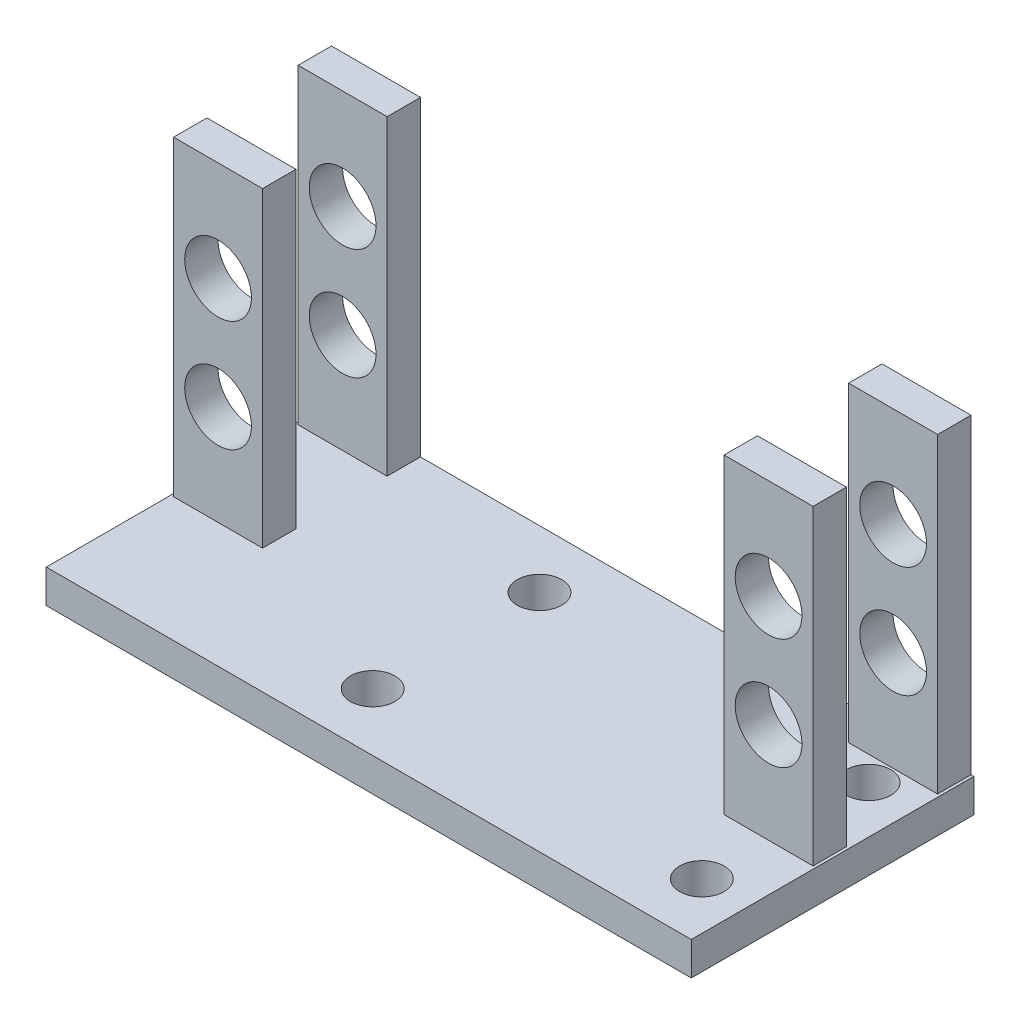
ISO-10303-21;
HEADER;
FILE_DESCRIPTION(('STEP AP214'),'2;1');
FILE_NAME('part.step','',(''),(''),'','','');
FILE_SCHEMA(('AUTOMOTIVE_DESIGN { 1 0 10303 214 1 1 1 1 }'));
ENDSEC;
DATA;
#1=APPLICATION_CONTEXT('core data for automotive mechanical design processes');
#2=APPLICATION_PROTOCOL_DEFINITION('international standard','automotive_design',2000,#1);
#3=PRODUCT_CONTEXT('',#1,'mechanical');
#4=PRODUCT('Part','Part','',(#3));
#5=PRODUCT_RELATED_PRODUCT_CATEGORY('part','',(#4));
#6=PRODUCT_DEFINITION_FORMATION('','',#4);
#7=PRODUCT_DEFINITION_CONTEXT('part definition',#1,'design');
#8=PRODUCT_DEFINITION('design','',#6,#7);
#9=PRODUCT_DEFINITION_SHAPE('','',#8);
#10=(LENGTH_UNIT() NAMED_UNIT(*) SI_UNIT(.MILLI.,.METRE.));
#11=(NAMED_UNIT(*) PLANE_ANGLE_UNIT() SI_UNIT($,.RADIAN.));
#12=(NAMED_UNIT(*) SI_UNIT($,.STERADIAN.) SOLID_ANGLE_UNIT());
#13=UNCERTAINTY_MEASURE_WITH_UNIT(LENGTH_MEASURE(1.E-05),#10,'distance_accuracy_value','');
#14=(GEOMETRIC_REPRESENTATION_CONTEXT(3) GLOBAL_UNCERTAINTY_ASSIGNED_CONTEXT((#13)) GLOBAL_UNIT_ASSIGNED_CONTEXT((#10,
#11,#12)) REPRESENTATION_CONTEXT('',''));
#15=CARTESIAN_POINT('',(0.,0.,0.));
#16=DIRECTION('',(0.,0.,1.));
#17=DIRECTION('',(1.,0.,0.));
#18=AXIS2_PLACEMENT_3D('',#15,#16,#17);
#19=CARTESIAN_POINT('',(0.,3.,0.));
#20=DIRECTION('',(0.,1.,0.));
#21=DIRECTION('',(0.,0.,1.));
#22=AXIS2_PLACEMENT_3D('',#19,#20,#21);
#23=PLANE('',#22);
#24=CARTESIAN_POINT('',(-4.85,3.,7.5));
#25=DIRECTION('',(0.,1.,0.));
#26=DIRECTION('',(0.,0.,-1.));
#27=AXIS2_PLACEMENT_3D('',#24,#25,#26);
#28=CIRCLE('',#27,2.);
#29=CARTESIAN_POINT('',(-4.85,3.,5.5));
#30=VERTEX_POINT('',#29);
#31=EDGE_CURVE('E542',#30,#30,#28,.T.);
#32=ORIENTED_EDGE('',*,*,#31,.F.);
#33=EDGE_LOOP('',(#32));
#34=FACE_BOUND('',#33,.T.);
#35=CARTESIAN_POINT('',(24.75,3.,-7.5));
#36=DIRECTION('',(0.,1.,0.));
#37=DIRECTION('',(0.,0.,-1.));
#38=AXIS2_PLACEMENT_3D('',#35,#36,#37);
#39=CIRCLE('',#38,2.);
#40=CARTESIAN_POINT('',(24.75,3.,-9.5));
#41=VERTEX_POINT('',#40);
#42=EDGE_CURVE('E538',#41,#41,#39,.T.);
#43=ORIENTED_EDGE('',*,*,#42,.F.);
#44=EDGE_LOOP('',(#43));
#45=FACE_BOUND('',#44,.T.);
#46=CARTESIAN_POINT('',(24.75,3.,7.5));
#47=DIRECTION('',(0.,1.,0.));
#48=DIRECTION('',(0.,0.,1.));
#49=AXIS2_PLACEMENT_3D('',#46,#47,#48);
#50=CIRCLE('',#49,2.);
#51=CARTESIAN_POINT('',(24.75,3.,9.5));
#52=VERTEX_POINT('',#51);
#53=EDGE_CURVE('E535',#52,#52,#50,.T.);
#54=ORIENTED_EDGE('',*,*,#53,.F.);
#55=EDGE_LOOP('',(#54));
#56=FACE_BOUND('',#55,.T.);
#57=CARTESIAN_POINT('',(-4.85,3.,-7.5));
#58=DIRECTION('',(0.,1.,0.));
#59=DIRECTION('',(0.,0.,1.));
#60=AXIS2_PLACEMENT_3D('',#57,#58,#59);
#61=CIRCLE('',#60,2.);
#62=CARTESIAN_POINT('',(-4.85,3.,-5.5));
#63=VERTEX_POINT('',#62);
#64=EDGE_CURVE('E341',#63,#63,#61,.T.);
#65=ORIENTED_EDGE('',*,*,#64,.F.);
#66=EDGE_LOOP('',(#65));
#67=FACE_BOUND('',#66,.T.);
#68=DIRECTION('',(-1.,0.,0.));
#69=VECTOR('',#68,1.);
#70=CARTESIAN_POINT('',(-29.,3.,-12.7));
#71=LINE('',#70,#69);
#72=CARTESIAN_POINT('',(29.,3.,-12.7));
#73=VERTEX_POINT('',#72);
#74=CARTESIAN_POINT('',(28.75,3.,-12.7));
#75=VERTEX_POINT('',#74);
#76=EDGE_CURVE('E295',#73,#75,#71,.T.);
#77=ORIENTED_EDGE('',*,*,#76,.T.);
#78=DIRECTION('',(0.,0.,-1.));
#79=VECTOR('',#78,1.);
#80=CARTESIAN_POINT('',(28.75,3.,-9.7));
#81=LINE('',#80,#79);
#82=CARTESIAN_POINT('',(28.75,3.,-9.7));
#83=VERTEX_POINT('',#82);
#84=EDGE_CURVE('E233',#83,#75,#81,.T.);
#85=ORIENTED_EDGE('',*,*,#84,.F.);
#86=DIRECTION('',(1.,0.,0.));
#87=VECTOR('',#86,1.);
#88=CARTESIAN_POINT('',(20.75,3.,-9.7));
#89=LINE('',#88,#87);
#90=CARTESIAN_POINT('',(20.75,3.,-9.7));
#91=VERTEX_POINT('',#90);
#92=EDGE_CURVE('E238',#91,#83,#89,.T.);
#93=ORIENTED_EDGE('',*,*,#92,.F.);
#94=DIRECTION('',(0.,0.,1.));
#95=VECTOR('',#94,1.);
#96=CARTESIAN_POINT('',(20.75,3.,-12.7));
#97=LINE('',#96,#95);
#98=CARTESIAN_POINT('',(20.75,3.,-12.7));
#99=VERTEX_POINT('',#98);
#100=EDGE_CURVE('E247',#99,#91,#97,.T.);
#101=ORIENTED_EDGE('',*,*,#100,.F.);
#102=CARTESIAN_POINT('',(-20.75,3.,-12.7));
#103=VERTEX_POINT('',#102);
#104=EDGE_CURVE('E299',#99,#103,#71,.T.);
#105=ORIENTED_EDGE('',*,*,#104,.T.);
#106=DIRECTION('',(0.,0.,-1.));
#107=VECTOR('',#106,1.);
#108=CARTESIAN_POINT('',(-20.75,3.,-12.7));
#109=LINE('',#108,#107);
#110=CARTESIAN_POINT('',(-20.75,3.,-9.7));
#111=VERTEX_POINT('',#110);
#112=EDGE_CURVE('E264',#111,#103,#109,.T.);
#113=ORIENTED_EDGE('',*,*,#112,.F.);
#114=DIRECTION('',(1.,0.,0.));
#115=VECTOR('',#114,1.);
#116=CARTESIAN_POINT('',(-20.75,3.,-9.7));
#117=LINE('',#116,#115);
#118=CARTESIAN_POINT('',(-28.75,3.,-9.7));
#119=VERTEX_POINT('',#118);
#120=EDGE_CURVE('E273',#119,#111,#117,.T.);
#121=ORIENTED_EDGE('',*,*,#120,.F.);
#122=DIRECTION('',(0.,0.,1.));
#123=VECTOR('',#122,1.);
#124=CARTESIAN_POINT('',(-28.75,3.,-9.7));
#125=LINE('',#124,#123);
#126=CARTESIAN_POINT('',(-28.75,3.,-12.7));
#127=VERTEX_POINT('',#126);
#128=EDGE_CURVE('E259',#127,#119,#125,.T.);
#129=ORIENTED_EDGE('',*,*,#128,.F.);
#130=CARTESIAN_POINT('',(-29.,3.,-12.7));
#131=VERTEX_POINT('',#130);
#132=EDGE_CURVE('E293',#127,#131,#71,.T.);
#133=ORIENTED_EDGE('',*,*,#132,.T.);
#134=DIRECTION('',(0.,0.,1.));
#135=VECTOR('',#134,1.);
#136=CARTESIAN_POINT('',(-29.,3.,-12.7));
#137=LINE('',#136,#135);
#138=CARTESIAN_POINT('',(-29.,3.,12.7));
#139=VERTEX_POINT('',#138);
#140=EDGE_CURVE('E298',#131,#139,#137,.T.);
#141=ORIENTED_EDGE('',*,*,#140,.T.);
#142=DIRECTION('',(1.,0.,0.));
#143=VECTOR('',#142,1.);
#144=CARTESIAN_POINT('',(-29.,3.,12.7));
#145=LINE('',#144,#143);
#146=CARTESIAN_POINT('',(29.,3.,12.7));
#147=VERTEX_POINT('',#146);
#148=EDGE_CURVE('E301',#139,#147,#145,.T.);
#149=ORIENTED_EDGE('',*,*,#148,.T.);
#150=DIRECTION('',(0.,0.,-1.));
#151=VECTOR('',#150,1.);
#152=CARTESIAN_POINT('',(29.,3.,-12.7));
#153=LINE('',#152,#151);
#154=EDGE_CURVE('E290',#147,#73,#153,.T.);
#155=ORIENTED_EDGE('',*,*,#154,.T.);
#156=EDGE_LOOP('',(#77,#85,#93,#101,#105,#113,#121,#129,#133,#141,#149,#155));
#157=FACE_BOUND('',#156,.T.);
#158=DIRECTION('',(-1.,0.,0.));
#159=VECTOR('',#158,1.);
#160=CARTESIAN_POINT('',(-28.75,3.,-1.5));
#161=LINE('',#160,#159);
#162=CARTESIAN_POINT('',(-20.75,3.,-1.5));
#163=VERTEX_POINT('',#162);
#164=CARTESIAN_POINT('',(-28.75,3.,-1.5));
#165=VERTEX_POINT('',#164);
#166=EDGE_CURVE('E205',#163,#165,#161,.T.);
#167=ORIENTED_EDGE('',*,*,#166,.F.);
#168=DIRECTION('',(0.,0.,-1.));
#169=VECTOR('',#168,1.);
#170=CARTESIAN_POINT('',(-20.75,3.,-1.5));
#171=LINE('',#170,#169);
#172=CARTESIAN_POINT('',(-20.75,3.,1.5));
#173=VERTEX_POINT('',#172);
#174=EDGE_CURVE('E202',#173,#163,#171,.T.);
#175=ORIENTED_EDGE('',*,*,#174,.F.);
#176=DIRECTION('',(1.,0.,0.));
#177=VECTOR('',#176,1.);
#178=CARTESIAN_POINT('',(-20.75,3.,1.5));
#179=LINE('',#178,#177);
#180=CARTESIAN_POINT('',(-28.75,3.,1.5));
#181=VERTEX_POINT('',#180);
#182=EDGE_CURVE('E214',#181,#173,#179,.T.);
#183=ORIENTED_EDGE('',*,*,#182,.F.);
#184=DIRECTION('',(0.,0.,1.));
#185=VECTOR('',#184,1.);
#186=CARTESIAN_POINT('',(-28.75,3.,1.5));
#187=LINE('',#186,#185);
#188=EDGE_CURVE('E222',#165,#181,#187,.T.);
#189=ORIENTED_EDGE('',*,*,#188,.F.);
#190=EDGE_LOOP('',(#167,#175,#183,#189));
#191=FACE_BOUND('',#190,.T.);
#192=DIRECTION('',(0.,0.,-1.));
#193=VECTOR('',#192,1.);
#194=CARTESIAN_POINT('',(28.75,3.,1.5));
#195=LINE('',#194,#193);
#196=CARTESIAN_POINT('',(28.75,3.,1.5));
#197=VERTEX_POINT('',#196);
#198=CARTESIAN_POINT('',(28.75,3.,-1.5));
#199=VERTEX_POINT('',#198);
#200=EDGE_CURVE('E571',#197,#199,#195,.T.);
#201=ORIENTED_EDGE('',*,*,#200,.F.);
#202=DIRECTION('',(1.,0.,0.));
#203=VECTOR('',#202,1.);
#204=CARTESIAN_POINT('',(20.75,3.,1.5));
#205=LINE('',#204,#203);
#206=CARTESIAN_POINT('',(20.75,3.,1.5));
#207=VERTEX_POINT('',#206);
#208=EDGE_CURVE('E200',#207,#197,#205,.T.);
#209=ORIENTED_EDGE('',*,*,#208,.F.);
#210=DIRECTION('',(0.,0.,1.));
#211=VECTOR('',#210,1.);
#212=CARTESIAN_POINT('',(20.75,3.,-1.5));
#213=LINE('',#212,#211);
#214=CARTESIAN_POINT('',(20.75,3.,-1.5));
#215=VERTEX_POINT('',#214);
#216=EDGE_CURVE('E196',#215,#207,#213,.T.);
#217=ORIENTED_EDGE('',*,*,#216,.F.);
#218=DIRECTION('',(-1.,0.,0.));
#219=VECTOR('',#218,1.);
#220=CARTESIAN_POINT('',(28.75,3.,-1.5));
#221=LINE('',#220,#219);
#222=EDGE_CURVE('E573',#199,#215,#221,.T.);
#223=ORIENTED_EDGE('',*,*,#222,.F.);
#224=EDGE_LOOP('',(#201,#209,#217,#223));
#225=FACE_BOUND('',#224,.T.);
#226=ADVANCED_FACE('F37',(#34,#45,#56,#67,#157,#191,#225),#23,.T.);
#227=CARTESIAN_POINT('',(29.,3.,-12.7));
#228=DIRECTION('',(-1.,0.,0.));
#229=DIRECTION('',(0.,0.,1.));
#230=AXIS2_PLACEMENT_3D('',#227,#228,#229);
#231=PLANE('',#230);
#232=DIRECTION('',(0.,0.,-1.));
#233=VECTOR('',#232,1.);
#234=CARTESIAN_POINT('',(29.,0.,-12.7));
#235=LINE('',#234,#233);
#236=CARTESIAN_POINT('',(29.,0.,12.7));
#237=VERTEX_POINT('',#236);
#238=CARTESIAN_POINT('',(29.,0.,-12.7));
#239=VERTEX_POINT('',#238);
#240=EDGE_CURVE('E289',#237,#239,#235,.T.);
#241=ORIENTED_EDGE('',*,*,#240,.T.);
#242=DIRECTION('',(0.,-1.,0.));
#243=VECTOR('',#242,1.);
#244=CARTESIAN_POINT('',(29.,3.,-12.7));
#245=LINE('',#244,#243);
#246=EDGE_CURVE('E11',#73,#239,#245,.T.);
#247=ORIENTED_EDGE('',*,*,#246,.F.);
#248=ORIENTED_EDGE('',*,*,#154,.F.);
#249=DIRECTION('',(0.,-1.,0.));
#250=VECTOR('',#249,1.);
#251=CARTESIAN_POINT('',(29.,3.,12.7));
#252=LINE('',#251,#250);
#253=EDGE_CURVE('E303',#147,#237,#252,.T.);
#254=ORIENTED_EDGE('',*,*,#253,.T.);
#255=EDGE_LOOP('',(#241,#247,#248,#254));
#256=FACE_BOUND('',#255,.T.);
#257=ADVANCED_FACE('F39',(#256),#231,.F.);
#258=CARTESIAN_POINT('',(-29.,3.,-12.7));
#259=DIRECTION('',(0.,0.,1.));
#260=DIRECTION('',(1.,0.,0.));
#261=AXIS2_PLACEMENT_3D('',#258,#259,#260);
#262=PLANE('',#261);
#263=CARTESIAN_POINT('',(-24.75,22.,-12.7));
#264=DIRECTION('',(0.,0.,1.));
#265=DIRECTION('',(1.,0.,0.));
#266=AXIS2_PLACEMENT_3D('',#263,#264,#265);
#267=CIRCLE('',#266,3.);
#268=CARTESIAN_POINT('',(-21.75,22.,-12.7));
#269=VERTEX_POINT('',#268);
#270=EDGE_CURVE('E395',#269,#269,#267,.T.);
#271=ORIENTED_EDGE('',*,*,#270,.T.);
#272=EDGE_LOOP('',(#271));
#273=FACE_BOUND('',#272,.T.);
#274=CARTESIAN_POINT('',(24.75,12.,-12.7));
#275=DIRECTION('',(0.,0.,1.));
#276=DIRECTION('',(1.,0.,0.));
#277=AXIS2_PLACEMENT_3D('',#274,#275,#276);
#278=CIRCLE('',#277,3.);
#279=CARTESIAN_POINT('',(27.75,12.,-12.7));
#280=VERTEX_POINT('',#279);
#281=EDGE_CURVE('E331',#280,#280,#278,.T.);
#282=ORIENTED_EDGE('',*,*,#281,.T.);
#283=EDGE_LOOP('',(#282));
#284=FACE_BOUND('',#283,.T.);
#285=CARTESIAN_POINT('',(24.75,22.,-12.7));
#286=DIRECTION('',(0.,0.,1.));
#287=DIRECTION('',(1.,0.,0.));
#288=AXIS2_PLACEMENT_3D('',#285,#286,#287);
#289=CIRCLE('',#288,3.);
#290=CARTESIAN_POINT('',(27.75,22.,-12.7));
#291=VERTEX_POINT('',#290);
#292=EDGE_CURVE('E326',#291,#291,#289,.T.);
#293=ORIENTED_EDGE('',*,*,#292,.T.);
#294=EDGE_LOOP('',(#293));
#295=FACE_BOUND('',#294,.T.);
#296=CARTESIAN_POINT('',(-24.75,12.,-12.7));
#297=DIRECTION('',(0.,0.,1.));
#298=DIRECTION('',(1.,0.,0.));
#299=AXIS2_PLACEMENT_3D('',#296,#297,#298);
#300=CIRCLE('',#299,3.);
#301=CARTESIAN_POINT('',(-21.75,12.,-12.7));
#302=VERTEX_POINT('',#301);
#303=EDGE_CURVE('E336',#302,#302,#300,.T.);
#304=ORIENTED_EDGE('',*,*,#303,.T.);
#305=EDGE_LOOP('',(#304));
#306=FACE_BOUND('',#305,.T.);
#307=DIRECTION('',(-1.,0.,0.));
#308=VECTOR('',#307,1.);
#309=CARTESIAN_POINT('',(-29.,0.,-12.7));
#310=LINE('',#309,#308);
#311=CARTESIAN_POINT('',(-29.,0.,-12.7));
#312=VERTEX_POINT('',#311);
#313=EDGE_CURVE('E306',#239,#312,#310,.T.);
#314=ORIENTED_EDGE('',*,*,#313,.T.);
#315=DIRECTION('',(0.,-1.,0.));
#316=VECTOR('',#315,1.);
#317=CARTESIAN_POINT('',(-29.,3.,-12.7));
#318=LINE('',#317,#316);
#319=EDGE_CURVE('E46',#131,#312,#318,.T.);
#320=ORIENTED_EDGE('',*,*,#319,.F.);
#321=ORIENTED_EDGE('',*,*,#132,.F.);
#322=DIRECTION('',(0.,-1.,0.));
#323=VECTOR('',#322,1.);
#324=CARTESIAN_POINT('',(-28.75,31.,-12.7));
#325=LINE('',#324,#323);
#326=CARTESIAN_POINT('',(-28.75,31.,-12.7));
#327=VERTEX_POINT('',#326);
#328=EDGE_CURVE('E270',#327,#127,#325,.T.);
#329=ORIENTED_EDGE('',*,*,#328,.F.);
#330=DIRECTION('',(-1.,0.,0.));
#331=VECTOR('',#330,1.);
#332=CARTESIAN_POINT('',(-28.75,31.,-12.7));
#333=LINE('',#332,#331);
#334=CARTESIAN_POINT('',(-20.75,31.,-12.7));
#335=VERTEX_POINT('',#334);
#336=EDGE_CURVE('E268',#335,#327,#333,.T.);
#337=ORIENTED_EDGE('',*,*,#336,.F.);
#338=DIRECTION('',(0.,-1.,0.));
#339=VECTOR('',#338,1.);
#340=CARTESIAN_POINT('',(-20.75,31.,-12.7));
#341=LINE('',#340,#339);
#342=EDGE_CURVE('E280',#335,#103,#341,.T.);
#343=ORIENTED_EDGE('',*,*,#342,.T.);
#344=ORIENTED_EDGE('',*,*,#104,.F.);
#345=DIRECTION('',(0.,-1.,0.));
#346=VECTOR('',#345,1.);
#347=CARTESIAN_POINT('',(20.75,31.,-12.7));
#348=LINE('',#347,#346);
#349=CARTESIAN_POINT('',(20.75,31.,-12.7));
#350=VERTEX_POINT('',#349);
#351=EDGE_CURVE('E255',#350,#99,#348,.T.);
#352=ORIENTED_EDGE('',*,*,#351,.F.);
#353=DIRECTION('',(-1.,0.,0.));
#354=VECTOR('',#353,1.);
#355=CARTESIAN_POINT('',(28.75,31.,-12.7));
#356=LINE('',#355,#354);
#357=CARTESIAN_POINT('',(28.75,31.,-12.7));
#358=VERTEX_POINT('',#357);
#359=EDGE_CURVE('E237',#358,#350,#356,.T.);
#360=ORIENTED_EDGE('',*,*,#359,.F.);
#361=DIRECTION('',(0.,-1.,0.));
#362=VECTOR('',#361,1.);
#363=CARTESIAN_POINT('',(28.75,31.,-12.7));
#364=LINE('',#363,#362);
#365=EDGE_CURVE('E257',#358,#75,#364,.T.);
#366=ORIENTED_EDGE('',*,*,#365,.T.);
#367=ORIENTED_EDGE('',*,*,#76,.F.);
#368=ORIENTED_EDGE('',*,*,#246,.T.);
#369=EDGE_LOOP('',(#314,#320,#321,#329,#337,#343,#344,#352,#360,#366,#367,#368));
#370=FACE_BOUND('',#369,.T.);
#371=ADVANCED_FACE('F371',(#273,#284,#295,#306,#370),#262,.F.);
#372=CARTESIAN_POINT('',(-29.,3.,-12.7));
#373=DIRECTION('',(1.,0.,0.));
#374=DIRECTION('',(0.,0.,-1.));
#375=AXIS2_PLACEMENT_3D('',#372,#373,#374);
#376=PLANE('',#375);
#377=DIRECTION('',(0.,0.,1.));
#378=VECTOR('',#377,1.);
#379=CARTESIAN_POINT('',(-29.,0.,-12.7));
#380=LINE('',#379,#378);
#381=CARTESIAN_POINT('',(-29.,0.,12.7));
#382=VERTEX_POINT('',#381);
#383=EDGE_CURVE('E308',#312,#382,#380,.T.);
#384=ORIENTED_EDGE('',*,*,#383,.T.);
#385=DIRECTION('',(0.,-1.,0.));
#386=VECTOR('',#385,1.);
#387=CARTESIAN_POINT('',(-29.,3.,12.7));
#388=LINE('',#387,#386);
#389=EDGE_CURVE('E313',#139,#382,#388,.T.);
#390=ORIENTED_EDGE('',*,*,#389,.F.);
#391=ORIENTED_EDGE('',*,*,#140,.F.);
#392=ORIENTED_EDGE('',*,*,#319,.T.);
#393=EDGE_LOOP('',(#384,#390,#391,#392));
#394=FACE_BOUND('',#393,.T.);
#395=ADVANCED_FACE('F384',(#394),#376,.F.);
#396=CARTESIAN_POINT('',(-29.,3.,12.7));
#397=DIRECTION('',(0.,0.,-1.));
#398=DIRECTION('',(-1.,0.,0.));
#399=AXIS2_PLACEMENT_3D('',#396,#397,#398);
#400=PLANE('',#399);
#401=DIRECTION('',(1.,0.,0.));
#402=VECTOR('',#401,1.);
#403=CARTESIAN_POINT('',(-29.,0.,12.7));
#404=LINE('',#403,#402);
#405=EDGE_CURVE('E294',#382,#237,#404,.T.);
#406=ORIENTED_EDGE('',*,*,#405,.T.);
#407=ORIENTED_EDGE('',*,*,#253,.F.);
#408=ORIENTED_EDGE('',*,*,#148,.F.);
#409=ORIENTED_EDGE('',*,*,#389,.T.);
#410=EDGE_LOOP('',(#406,#407,#408,#409));
#411=FACE_BOUND('',#410,.T.);
#412=ADVANCED_FACE('F381',(#411),#400,.F.);
#413=CARTESIAN_POINT('',(0.,0.,0.));
#414=DIRECTION('',(0.,1.,0.));
#415=DIRECTION('',(0.,0.,1.));
#416=AXIS2_PLACEMENT_3D('',#413,#414,#415);
#417=PLANE('',#416);
#418=CARTESIAN_POINT('',(-4.85,0.,7.5));
#419=DIRECTION('',(0.,1.,0.));
#420=DIRECTION('',(0.,0.,1.));
#421=AXIS2_PLACEMENT_3D('',#418,#419,#420);
#422=CIRCLE('',#421,2.);
#423=CARTESIAN_POINT('',(-4.85,0.,9.5));
#424=VERTEX_POINT('',#423);
#425=EDGE_CURVE('E41',#424,#424,#422,.T.);
#426=ORIENTED_EDGE('',*,*,#425,.T.);
#427=EDGE_LOOP('',(#426));
#428=FACE_BOUND('',#427,.T.);
#429=CARTESIAN_POINT('',(24.75,0.,-7.5));
#430=DIRECTION('',(0.,1.,0.));
#431=DIRECTION('',(0.,0.,1.));
#432=AXIS2_PLACEMENT_3D('',#429,#430,#431);
#433=CIRCLE('',#432,2.);
#434=CARTESIAN_POINT('',(24.75,0.,-5.5));
#435=VERTEX_POINT('',#434);
#436=EDGE_CURVE('E343',#435,#435,#433,.T.);
#437=ORIENTED_EDGE('',*,*,#436,.T.);
#438=EDGE_LOOP('',(#437));
#439=FACE_BOUND('',#438,.T.);
#440=CARTESIAN_POINT('',(24.75,0.,7.5));
#441=DIRECTION('',(0.,1.,0.));
#442=DIRECTION('',(0.,0.,1.));
#443=AXIS2_PLACEMENT_3D('',#440,#441,#442);
#444=CIRCLE('',#443,2.);
#445=CARTESIAN_POINT('',(24.75,0.,9.5));
#446=VERTEX_POINT('',#445);
#447=EDGE_CURVE('E340',#446,#446,#444,.T.);
#448=ORIENTED_EDGE('',*,*,#447,.T.);
#449=EDGE_LOOP('',(#448));
#450=FACE_BOUND('',#449,.T.);
#451=CARTESIAN_POINT('',(-4.85,0.,-7.5));
#452=DIRECTION('',(0.,1.,0.));
#453=DIRECTION('',(0.,0.,1.));
#454=AXIS2_PLACEMENT_3D('',#451,#452,#453);
#455=CIRCLE('',#454,2.);
#456=CARTESIAN_POINT('',(-4.85,0.,-5.5));
#457=VERTEX_POINT('',#456);
#458=EDGE_CURVE('E337',#457,#457,#455,.T.);
#459=ORIENTED_EDGE('',*,*,#458,.T.);
#460=EDGE_LOOP('',(#459));
#461=FACE_BOUND('',#460,.T.);
#462=ORIENTED_EDGE('',*,*,#240,.F.);
#463=ORIENTED_EDGE('',*,*,#405,.F.);
#464=ORIENTED_EDGE('',*,*,#383,.F.);
#465=ORIENTED_EDGE('',*,*,#313,.F.);
#466=EDGE_LOOP('',(#462,#463,#464,#465));
#467=FACE_BOUND('',#466,.T.);
#468=ADVANCED_FACE('F350',(#428,#439,#450,#461,#467),#417,.F.);
#469=CARTESIAN_POINT('',(-28.75,31.,-9.7));
#470=DIRECTION('',(1.,0.,0.));
#471=DIRECTION('',(0.,0.,-1.));
#472=AXIS2_PLACEMENT_3D('',#469,#470,#471);
#473=PLANE('',#472);
#474=ORIENTED_EDGE('',*,*,#128,.T.);
#475=DIRECTION('',(0.,-1.,0.));
#476=VECTOR('',#475,1.);
#477=CARTESIAN_POINT('',(-28.75,31.,-9.7));
#478=LINE('',#477,#476);
#479=CARTESIAN_POINT('',(-28.75,31.,-9.7));
#480=VERTEX_POINT('',#479);
#481=EDGE_CURVE('E286',#480,#119,#478,.T.);
#482=ORIENTED_EDGE('',*,*,#481,.F.);
#483=DIRECTION('',(0.,0.,1.));
#484=VECTOR('',#483,1.);
#485=CARTESIAN_POINT('',(-28.75,31.,-9.7));
#486=LINE('',#485,#484);
#487=EDGE_CURVE('E260',#327,#480,#486,.T.);
#488=ORIENTED_EDGE('',*,*,#487,.F.);
#489=ORIENTED_EDGE('',*,*,#328,.T.);
#490=EDGE_LOOP('',(#474,#482,#488,#489));
#491=FACE_BOUND('',#490,.T.);
#492=ADVANCED_FACE('F377',(#491),#473,.F.);
#493=CARTESIAN_POINT('',(-20.75,31.,-9.7));
#494=DIRECTION('',(0.,0.,-1.));
#495=DIRECTION('',(-1.,0.,0.));
#496=AXIS2_PLACEMENT_3D('',#493,#494,#495);
#497=PLANE('',#496);
#498=CARTESIAN_POINT('',(-24.75,22.,-9.7));
#499=DIRECTION('',(0.,0.,-1.));
#500=DIRECTION('',(-1.,0.,0.));
#501=AXIS2_PLACEMENT_3D('',#498,#499,#500);
#502=CIRCLE('',#501,3.);
#503=CARTESIAN_POINT('',(-27.75,22.,-9.7));
#504=VERTEX_POINT('',#503);
#505=EDGE_CURVE('E564',#504,#504,#502,.T.);
#506=ORIENTED_EDGE('',*,*,#505,.T.);
#507=EDGE_LOOP('',(#506));
#508=FACE_BOUND('',#507,.T.);
#509=CARTESIAN_POINT('',(-24.75,12.,-9.7));
#510=DIRECTION('',(0.,0.,-1.));
#511=DIRECTION('',(-1.,0.,0.));
#512=AXIS2_PLACEMENT_3D('',#509,#510,#511);
#513=CIRCLE('',#512,3.);
#514=CARTESIAN_POINT('',(-27.75,12.,-9.7));
#515=VERTEX_POINT('',#514);
#516=EDGE_CURVE('E558',#515,#515,#513,.T.);
#517=ORIENTED_EDGE('',*,*,#516,.T.);
#518=EDGE_LOOP('',(#517));
#519=FACE_BOUND('',#518,.T.);
#520=ORIENTED_EDGE('',*,*,#120,.T.);
#521=DIRECTION('',(0.,-1.,0.));
#522=VECTOR('',#521,1.);
#523=CARTESIAN_POINT('',(-20.75,31.,-9.7));
#524=LINE('',#523,#522);
#525=CARTESIAN_POINT('',(-20.75,31.,-9.7));
#526=VERTEX_POINT('',#525);
#527=EDGE_CURVE('E283',#526,#111,#524,.T.);
#528=ORIENTED_EDGE('',*,*,#527,.F.);
#529=DIRECTION('',(1.,0.,0.));
#530=VECTOR('',#529,1.);
#531=CARTESIAN_POINT('',(-20.75,31.,-9.7));
#532=LINE('',#531,#530);
#533=EDGE_CURVE('E263',#480,#526,#532,.T.);
#534=ORIENTED_EDGE('',*,*,#533,.F.);
#535=ORIENTED_EDGE('',*,*,#481,.T.);
#536=EDGE_LOOP('',(#520,#528,#534,#535));
#537=FACE_BOUND('',#536,.T.);
#538=ADVANCED_FACE('F436',(#508,#519,#537),#497,.F.);
#539=CARTESIAN_POINT('',(-20.75,31.,-12.7));
#540=DIRECTION('',(-1.,0.,0.));
#541=DIRECTION('',(0.,0.,1.));
#542=AXIS2_PLACEMENT_3D('',#539,#540,#541);
#543=PLANE('',#542);
#544=ORIENTED_EDGE('',*,*,#112,.T.);
#545=ORIENTED_EDGE('',*,*,#342,.F.);
#546=DIRECTION('',(0.,0.,-1.));
#547=VECTOR('',#546,1.);
#548=CARTESIAN_POINT('',(-20.75,31.,-12.7));
#549=LINE('',#548,#547);
#550=EDGE_CURVE('E266',#526,#335,#549,.T.);
#551=ORIENTED_EDGE('',*,*,#550,.F.);
#552=ORIENTED_EDGE('',*,*,#527,.T.);
#553=EDGE_LOOP('',(#544,#545,#551,#552));
#554=FACE_BOUND('',#553,.T.);
#555=ADVANCED_FACE('F427',(#554),#543,.F.);
#556=CARTESIAN_POINT('',(0.,31.,0.));
#557=DIRECTION('',(0.,-1.,0.));
#558=DIRECTION('',(0.,0.,-1.));
#559=AXIS2_PLACEMENT_3D('',#556,#557,#558);
#560=PLANE('',#559);
#561=ORIENTED_EDGE('',*,*,#487,.T.);
#562=ORIENTED_EDGE('',*,*,#533,.T.);
#563=ORIENTED_EDGE('',*,*,#550,.T.);
#564=ORIENTED_EDGE('',*,*,#336,.T.);
#565=EDGE_LOOP('',(#561,#562,#563,#564));
#566=FACE_BOUND('',#565,.T.);
#567=ADVANCED_FACE('F433',(#566),#560,.F.);
#568=CARTESIAN_POINT('',(28.75,31.,-9.7));
#569=DIRECTION('',(-1.,0.,0.));
#570=DIRECTION('',(0.,0.,1.));
#571=AXIS2_PLACEMENT_3D('',#568,#569,#570);
#572=PLANE('',#571);
#573=ORIENTED_EDGE('',*,*,#84,.T.);
#574=ORIENTED_EDGE('',*,*,#365,.F.);
#575=DIRECTION('',(0.,0.,-1.));
#576=VECTOR('',#575,1.);
#577=CARTESIAN_POINT('',(28.75,31.,-9.7));
#578=LINE('',#577,#576);
#579=CARTESIAN_POINT('',(28.75,31.,-9.7));
#580=VERTEX_POINT('',#579);
#581=EDGE_CURVE('E234',#580,#358,#578,.T.);
#582=ORIENTED_EDGE('',*,*,#581,.F.);
#583=DIRECTION('',(0.,-1.,0.));
#584=VECTOR('',#583,1.);
#585=CARTESIAN_POINT('',(28.75,31.,-9.7));
#586=LINE('',#585,#584);
#587=EDGE_CURVE('E244',#580,#83,#586,.T.);
#588=ORIENTED_EDGE('',*,*,#587,.T.);
#589=EDGE_LOOP('',(#573,#574,#582,#588));
#590=FACE_BOUND('',#589,.T.);
#591=ADVANCED_FACE('F452',(#590),#572,.F.);
#592=CARTESIAN_POINT('',(20.75,31.,-12.7));
#593=DIRECTION('',(1.,0.,0.));
#594=DIRECTION('',(0.,0.,-1.));
#595=AXIS2_PLACEMENT_3D('',#592,#593,#594);
#596=PLANE('',#595);
#597=ORIENTED_EDGE('',*,*,#100,.T.);
#598=DIRECTION('',(0.,-1.,0.));
#599=VECTOR('',#598,1.);
#600=CARTESIAN_POINT('',(20.75,31.,-9.7));
#601=LINE('',#600,#599);
#602=CARTESIAN_POINT('',(20.75,31.,-9.7));
#603=VERTEX_POINT('',#602);
#604=EDGE_CURVE('E253',#603,#91,#601,.T.);
#605=ORIENTED_EDGE('',*,*,#604,.F.);
#606=DIRECTION('',(0.,0.,1.));
#607=VECTOR('',#606,1.);
#608=CARTESIAN_POINT('',(20.75,31.,-12.7));
#609=LINE('',#608,#607);
#610=EDGE_CURVE('E240',#350,#603,#609,.T.);
#611=ORIENTED_EDGE('',*,*,#610,.F.);
#612=ORIENTED_EDGE('',*,*,#351,.T.);
#613=EDGE_LOOP('',(#597,#605,#611,#612));
#614=FACE_BOUND('',#613,.T.);
#615=ADVANCED_FACE('F455',(#614),#596,.F.);
#616=CARTESIAN_POINT('',(20.75,31.,-9.7));
#617=DIRECTION('',(0.,0.,-1.));
#618=DIRECTION('',(-1.,0.,0.));
#619=AXIS2_PLACEMENT_3D('',#616,#617,#618);
#620=PLANE('',#619);
#621=CARTESIAN_POINT('',(24.75,12.,-9.7));
#622=DIRECTION('',(0.,0.,-1.));
#623=DIRECTION('',(-1.,0.,0.));
#624=AXIS2_PLACEMENT_3D('',#621,#622,#623);
#625=CIRCLE('',#624,3.);
#626=CARTESIAN_POINT('',(21.75,12.,-9.7));
#627=VERTEX_POINT('',#626);
#628=EDGE_CURVE('E552',#627,#627,#625,.T.);
#629=ORIENTED_EDGE('',*,*,#628,.T.);
#630=EDGE_LOOP('',(#629));
#631=FACE_BOUND('',#630,.T.);
#632=CARTESIAN_POINT('',(24.75,22.,-9.7));
#633=DIRECTION('',(0.,0.,-1.));
#634=DIRECTION('',(-1.,0.,0.));
#635=AXIS2_PLACEMENT_3D('',#632,#633,#634);
#636=CIRCLE('',#635,3.);
#637=CARTESIAN_POINT('',(21.75,22.,-9.7));
#638=VERTEX_POINT('',#637);
#639=EDGE_CURVE('E546',#638,#638,#636,.T.);
#640=ORIENTED_EDGE('',*,*,#639,.T.);
#641=EDGE_LOOP('',(#640));
#642=FACE_BOUND('',#641,.T.);
#643=ORIENTED_EDGE('',*,*,#92,.T.);
#644=ORIENTED_EDGE('',*,*,#587,.F.);
#645=DIRECTION('',(1.,0.,0.));
#646=VECTOR('',#645,1.);
#647=CARTESIAN_POINT('',(20.75,31.,-9.7));
#648=LINE('',#647,#646);
#649=EDGE_CURVE('E242',#603,#580,#648,.T.);
#650=ORIENTED_EDGE('',*,*,#649,.F.);
#651=ORIENTED_EDGE('',*,*,#604,.T.);
#652=EDGE_LOOP('',(#643,#644,#650,#651));
#653=FACE_BOUND('',#652,.T.);
#654=ADVANCED_FACE('F459',(#631,#642,#653),#620,.F.);
#655=CARTESIAN_POINT('',(0.,31.,0.));
#656=DIRECTION('',(0.,1.,0.));
#657=DIRECTION('',(0.,0.,1.));
#658=AXIS2_PLACEMENT_3D('',#655,#656,#657);
#659=PLANE('',#658);
#660=ORIENTED_EDGE('',*,*,#581,.T.);
#661=ORIENTED_EDGE('',*,*,#359,.T.);
#662=ORIENTED_EDGE('',*,*,#610,.T.);
#663=ORIENTED_EDGE('',*,*,#649,.T.);
#664=EDGE_LOOP('',(#660,#661,#662,#663));
#665=FACE_BOUND('',#664,.T.);
#666=ADVANCED_FACE('F463',(#665),#659,.T.);
#667=CARTESIAN_POINT('',(-20.75,31.,-1.5));
#668=DIRECTION('',(-1.,0.,0.));
#669=DIRECTION('',(0.,0.,1.));
#670=AXIS2_PLACEMENT_3D('',#667,#668,#669);
#671=PLANE('',#670);
#672=ORIENTED_EDGE('',*,*,#174,.T.);
#673=DIRECTION('',(0.,-1.,0.));
#674=VECTOR('',#673,1.);
#675=CARTESIAN_POINT('',(-20.75,31.,-1.5));
#676=LINE('',#675,#674);
#677=CARTESIAN_POINT('',(-20.75,31.,-1.5));
#678=VERTEX_POINT('',#677);
#679=EDGE_CURVE('E231',#678,#163,#676,.T.);
#680=ORIENTED_EDGE('',*,*,#679,.F.);
#681=DIRECTION('',(0.,0.,-1.));
#682=VECTOR('',#681,1.);
#683=CARTESIAN_POINT('',(-20.75,31.,-1.5));
#684=LINE('',#683,#682);
#685=CARTESIAN_POINT('',(-20.75,31.,1.5));
#686=VERTEX_POINT('',#685);
#687=EDGE_CURVE('E210',#686,#678,#684,.T.);
#688=ORIENTED_EDGE('',*,*,#687,.F.);
#689=DIRECTION('',(0.,-1.,0.));
#690=VECTOR('',#689,1.);
#691=CARTESIAN_POINT('',(-20.75,31.,1.5));
#692=LINE('',#691,#690);
#693=EDGE_CURVE('E219',#686,#173,#692,.T.);
#694=ORIENTED_EDGE('',*,*,#693,.T.);
#695=EDGE_LOOP('',(#672,#680,#688,#694));
#696=FACE_BOUND('',#695,.T.);
#697=ADVANCED_FACE('F467',(#696),#671,.F.);
#698=CARTESIAN_POINT('',(-28.75,31.,-1.5));
#699=DIRECTION('',(0.,0.,1.));
#700=DIRECTION('',(1.,0.,0.));
#701=AXIS2_PLACEMENT_3D('',#698,#699,#700);
#702=PLANE('',#701);
#703=CARTESIAN_POINT('',(-24.75,22.,-1.5));
#704=DIRECTION('',(0.,0.,1.));
#705=DIRECTION('',(1.,0.,0.));
#706=AXIS2_PLACEMENT_3D('',#703,#704,#705);
#707=CIRCLE('',#706,3.);
#708=CARTESIAN_POINT('',(-21.75,22.,-1.5));
#709=VERTEX_POINT('',#708);
#710=EDGE_CURVE('E335',#709,#709,#707,.T.);
#711=ORIENTED_EDGE('',*,*,#710,.T.);
#712=EDGE_LOOP('',(#711));
#713=FACE_BOUND('',#712,.T.);
#714=CARTESIAN_POINT('',(-24.75,12.,-1.5));
#715=DIRECTION('',(0.,0.,1.));
#716=DIRECTION('',(1.,0.,0.));
#717=AXIS2_PLACEMENT_3D('',#714,#715,#716);
#718=CIRCLE('',#717,3.);
#719=CARTESIAN_POINT('',(-21.75,12.,-1.5));
#720=VERTEX_POINT('',#719);
#721=EDGE_CURVE('E330',#720,#720,#718,.T.);
#722=ORIENTED_EDGE('',*,*,#721,.T.);
#723=EDGE_LOOP('',(#722));
#724=FACE_BOUND('',#723,.T.);
#725=ORIENTED_EDGE('',*,*,#166,.T.);
#726=DIRECTION('',(0.,-1.,0.));
#727=VECTOR('',#726,1.);
#728=CARTESIAN_POINT('',(-28.75,31.,-1.5));
#729=LINE('',#728,#727);
#730=CARTESIAN_POINT('',(-28.75,31.,-1.5));
#731=VERTEX_POINT('',#730);
#732=EDGE_CURVE('E228',#731,#165,#729,.T.);
#733=ORIENTED_EDGE('',*,*,#732,.F.);
#734=DIRECTION('',(-1.,0.,0.));
#735=VECTOR('',#734,1.);
#736=CARTESIAN_POINT('',(-28.75,31.,-1.5));
#737=LINE('',#736,#735);
#738=EDGE_CURVE('E213',#678,#731,#737,.T.);
#739=ORIENTED_EDGE('',*,*,#738,.F.);
#740=ORIENTED_EDGE('',*,*,#679,.T.);
#741=EDGE_LOOP('',(#725,#733,#739,#740));
#742=FACE_BOUND('',#741,.T.);
#743=ADVANCED_FACE('F471',(#713,#724,#742),#702,.F.);
#744=CARTESIAN_POINT('',(-28.75,31.,1.5));
#745=DIRECTION('',(1.,0.,0.));
#746=DIRECTION('',(0.,0.,-1.));
#747=AXIS2_PLACEMENT_3D('',#744,#745,#746);
#748=PLANE('',#747);
#749=ORIENTED_EDGE('',*,*,#188,.T.);
#750=DIRECTION('',(0.,-1.,0.));
#751=VECTOR('',#750,1.);
#752=CARTESIAN_POINT('',(-28.75,31.,1.5));
#753=LINE('',#752,#751);
#754=CARTESIAN_POINT('',(-28.75,31.,1.5));
#755=VERTEX_POINT('',#754);
#756=EDGE_CURVE('E62',#755,#181,#753,.T.);
#757=ORIENTED_EDGE('',*,*,#756,.F.);
#758=DIRECTION('',(0.,0.,1.));
#759=VECTOR('',#758,1.);
#760=CARTESIAN_POINT('',(-28.75,31.,1.5));
#761=LINE('',#760,#759);
#762=EDGE_CURVE('E216',#731,#755,#761,.T.);
#763=ORIENTED_EDGE('',*,*,#762,.F.);
#764=ORIENTED_EDGE('',*,*,#732,.T.);
#765=EDGE_LOOP('',(#749,#757,#763,#764));
#766=FACE_BOUND('',#765,.T.);
#767=ADVANCED_FACE('F475',(#766),#748,.F.);
#768=CARTESIAN_POINT('',(-20.75,31.,1.5));
#769=DIRECTION('',(0.,0.,-1.));
#770=DIRECTION('',(-1.,0.,0.));
#771=AXIS2_PLACEMENT_3D('',#768,#769,#770);
#772=PLANE('',#771);
#773=CARTESIAN_POINT('',(-24.75,22.,1.5));
#774=DIRECTION('',(0.,0.,-1.));
#775=DIRECTION('',(-1.,0.,0.));
#776=AXIS2_PLACEMENT_3D('',#773,#774,#775);
#777=CIRCLE('',#776,3.);
#778=CARTESIAN_POINT('',(-27.75,22.,1.5));
#779=VERTEX_POINT('',#778);
#780=EDGE_CURVE('E332',#779,#779,#777,.T.);
#781=ORIENTED_EDGE('',*,*,#780,.T.);
#782=EDGE_LOOP('',(#781));
#783=FACE_BOUND('',#782,.T.);
#784=CARTESIAN_POINT('',(-24.75,12.,1.5));
#785=DIRECTION('',(0.,0.,-1.));
#786=DIRECTION('',(-1.,0.,0.));
#787=AXIS2_PLACEMENT_3D('',#784,#785,#786);
#788=CIRCLE('',#787,3.);
#789=CARTESIAN_POINT('',(-27.75,12.,1.5));
#790=VERTEX_POINT('',#789);
#791=EDGE_CURVE('E327',#790,#790,#788,.T.);
#792=ORIENTED_EDGE('',*,*,#791,.T.);
#793=EDGE_LOOP('',(#792));
#794=FACE_BOUND('',#793,.T.);
#795=ORIENTED_EDGE('',*,*,#182,.T.);
#796=ORIENTED_EDGE('',*,*,#693,.F.);
#797=DIRECTION('',(1.,0.,0.));
#798=VECTOR('',#797,1.);
#799=CARTESIAN_POINT('',(-20.75,31.,1.5));
#800=LINE('',#799,#798);
#801=EDGE_CURVE('E218',#755,#686,#800,.T.);
#802=ORIENTED_EDGE('',*,*,#801,.F.);
#803=ORIENTED_EDGE('',*,*,#756,.T.);
#804=EDGE_LOOP('',(#795,#796,#802,#803));
#805=FACE_BOUND('',#804,.T.);
#806=ADVANCED_FACE('F479',(#783,#794,#805),#772,.F.);
#807=CARTESIAN_POINT('',(0.,31.,0.));
#808=DIRECTION('',(0.,-1.,0.));
#809=DIRECTION('',(0.,0.,-1.));
#810=AXIS2_PLACEMENT_3D('',#807,#808,#809);
#811=PLANE('',#810);
#812=ORIENTED_EDGE('',*,*,#687,.T.);
#813=ORIENTED_EDGE('',*,*,#738,.T.);
#814=ORIENTED_EDGE('',*,*,#762,.T.);
#815=ORIENTED_EDGE('',*,*,#801,.T.);
#816=EDGE_LOOP('',(#812,#813,#814,#815));
#817=FACE_BOUND('',#816,.T.);
#818=ADVANCED_FACE('F483',(#817),#811,.F.);
#819=CARTESIAN_POINT('',(20.75,31.,1.5));
#820=DIRECTION('',(0.,0.,-1.));
#821=DIRECTION('',(-1.,0.,0.));
#822=AXIS2_PLACEMENT_3D('',#819,#820,#821);
#823=PLANE('',#822);
#824=CARTESIAN_POINT('',(24.75,12.,1.5));
#825=DIRECTION('',(0.,0.,-1.));
#826=DIRECTION('',(-1.,0.,0.));
#827=AXIS2_PLACEMENT_3D('',#824,#825,#826);
#828=CIRCLE('',#827,3.);
#829=CARTESIAN_POINT('',(21.75,12.,1.5));
#830=VERTEX_POINT('',#829);
#831=EDGE_CURVE('E325',#830,#830,#828,.T.);
#832=ORIENTED_EDGE('',*,*,#831,.T.);
#833=EDGE_LOOP('',(#832));
#834=FACE_BOUND('',#833,.T.);
#835=CARTESIAN_POINT('',(24.75,22.,1.5));
#836=DIRECTION('',(0.,0.,-1.));
#837=DIRECTION('',(-1.,0.,0.));
#838=AXIS2_PLACEMENT_3D('',#835,#836,#837);
#839=CIRCLE('',#838,3.);
#840=CARTESIAN_POINT('',(21.75,22.,1.5));
#841=VERTEX_POINT('',#840);
#842=EDGE_CURVE('E321',#841,#841,#839,.T.);
#843=ORIENTED_EDGE('',*,*,#842,.T.);
#844=EDGE_LOOP('',(#843));
#845=FACE_BOUND('',#844,.T.);
#846=ORIENTED_EDGE('',*,*,#208,.T.);
#847=DIRECTION('',(0.,-1.,0.));
#848=VECTOR('',#847,1.);
#849=CARTESIAN_POINT('',(28.75,31.,1.5));
#850=LINE('',#849,#848);
#851=CARTESIAN_POINT('',(28.75,31.,1.5));
#852=VERTEX_POINT('',#851);
#853=EDGE_CURVE('E181',#852,#197,#850,.T.);
#854=ORIENTED_EDGE('',*,*,#853,.F.);
#855=DIRECTION('',(1.,0.,0.));
#856=VECTOR('',#855,1.);
#857=CARTESIAN_POINT('',(20.75,31.,1.5));
#858=LINE('',#857,#856);
#859=CARTESIAN_POINT('',(20.75,31.,1.5));
#860=VERTEX_POINT('',#859);
#861=EDGE_CURVE('E188',#860,#852,#858,.T.);
#862=ORIENTED_EDGE('',*,*,#861,.F.);
#863=DIRECTION('',(0.,-1.,0.));
#864=VECTOR('',#863,1.);
#865=CARTESIAN_POINT('',(20.75,31.,1.5));
#866=LINE('',#865,#864);
#867=EDGE_CURVE('E569',#860,#207,#866,.T.);
#868=ORIENTED_EDGE('',*,*,#867,.T.);
#869=EDGE_LOOP('',(#846,#854,#862,#868));
#870=FACE_BOUND('',#869,.T.);
#871=ADVANCED_FACE('F198',(#834,#845,#870),#823,.F.);
#872=CARTESIAN_POINT('',(28.75,31.,1.5));
#873=DIRECTION('',(-1.,0.,0.));
#874=DIRECTION('',(0.,0.,1.));
#875=AXIS2_PLACEMENT_3D('',#872,#873,#874);
#876=PLANE('',#875);
#877=ORIENTED_EDGE('',*,*,#200,.T.);
#878=DIRECTION('',(0.,-1.,0.));
#879=VECTOR('',#878,1.);
#880=CARTESIAN_POINT('',(28.75,31.,-1.5));
#881=LINE('',#880,#879);
#882=CARTESIAN_POINT('',(28.75,31.,-1.5));
#883=VERTEX_POINT('',#882);
#884=EDGE_CURVE('E184',#883,#199,#881,.T.);
#885=ORIENTED_EDGE('',*,*,#884,.F.);
#886=DIRECTION('',(0.,0.,-1.));
#887=VECTOR('',#886,1.);
#888=CARTESIAN_POINT('',(28.75,31.,1.5));
#889=LINE('',#888,#887);
#890=EDGE_CURVE('E177',#852,#883,#889,.T.);
#891=ORIENTED_EDGE('',*,*,#890,.F.);
#892=ORIENTED_EDGE('',*,*,#853,.T.);
#893=EDGE_LOOP('',(#877,#885,#891,#892));
#894=FACE_BOUND('',#893,.T.);
#895=ADVANCED_FACE('F179',(#894),#876,.F.);
#896=CARTESIAN_POINT('',(28.75,31.,-1.5));
#897=DIRECTION('',(0.,0.,1.));
#898=DIRECTION('',(1.,0.,0.));
#899=AXIS2_PLACEMENT_3D('',#896,#897,#898);
#900=PLANE('',#899);
#901=CARTESIAN_POINT('',(24.75,12.,-1.5));
#902=DIRECTION('',(0.,0.,1.));
#903=DIRECTION('',(1.,0.,0.));
#904=AXIS2_PLACEMENT_3D('',#901,#902,#903);
#905=CIRCLE('',#904,3.);
#906=CARTESIAN_POINT('',(27.75,12.,-1.5));
#907=VERTEX_POINT('',#906);
#908=EDGE_CURVE('E322',#907,#907,#905,.T.);
#909=ORIENTED_EDGE('',*,*,#908,.T.);
#910=EDGE_LOOP('',(#909));
#911=FACE_BOUND('',#910,.T.);
#912=CARTESIAN_POINT('',(24.75,22.,-1.5));
#913=DIRECTION('',(0.,0.,1.));
#914=DIRECTION('',(1.,0.,0.));
#915=AXIS2_PLACEMENT_3D('',#912,#913,#914);
#916=CIRCLE('',#915,3.);
#917=CARTESIAN_POINT('',(27.75,22.,-1.5));
#918=VERTEX_POINT('',#917);
#919=EDGE_CURVE('E318',#918,#918,#916,.T.);
#920=ORIENTED_EDGE('',*,*,#919,.T.);
#921=EDGE_LOOP('',(#920));
#922=FACE_BOUND('',#921,.T.);
#923=ORIENTED_EDGE('',*,*,#222,.T.);
#924=DIRECTION('',(0.,-1.,0.));
#925=VECTOR('',#924,1.);
#926=CARTESIAN_POINT('',(20.75,31.,-1.5));
#927=LINE('',#926,#925);
#928=CARTESIAN_POINT('',(20.75,31.,-1.5));
#929=VERTEX_POINT('',#928);
#930=EDGE_CURVE('E54',#929,#215,#927,.T.);
#931=ORIENTED_EDGE('',*,*,#930,.F.);
#932=DIRECTION('',(-1.,0.,0.));
#933=VECTOR('',#932,1.);
#934=CARTESIAN_POINT('',(28.75,31.,-1.5));
#935=LINE('',#934,#933);
#936=EDGE_CURVE('E187',#883,#929,#935,.T.);
#937=ORIENTED_EDGE('',*,*,#936,.F.);
#938=ORIENTED_EDGE('',*,*,#884,.T.);
#939=EDGE_LOOP('',(#923,#931,#937,#938));
#940=FACE_BOUND('',#939,.T.);
#941=ADVANCED_FACE('F493',(#911,#922,#940),#900,.F.);
#942=CARTESIAN_POINT('',(20.75,31.,-1.5));
#943=DIRECTION('',(1.,0.,0.));
#944=DIRECTION('',(0.,0.,-1.));
#945=AXIS2_PLACEMENT_3D('',#942,#943,#944);
#946=PLANE('',#945);
#947=ORIENTED_EDGE('',*,*,#216,.T.);
#948=ORIENTED_EDGE('',*,*,#867,.F.);
#949=DIRECTION('',(0.,0.,1.));
#950=VECTOR('',#949,1.);
#951=CARTESIAN_POINT('',(20.75,31.,-1.5));
#952=LINE('',#951,#950);
#953=EDGE_CURVE('E192',#929,#860,#952,.T.);
#954=ORIENTED_EDGE('',*,*,#953,.F.);
#955=ORIENTED_EDGE('',*,*,#930,.T.);
#956=EDGE_LOOP('',(#947,#948,#954,#955));
#957=FACE_BOUND('',#956,.T.);
#958=ADVANCED_FACE('F496',(#957),#946,.F.);
#959=CARTESIAN_POINT('',(0.,31.,0.));
#960=DIRECTION('',(0.,1.,0.));
#961=DIRECTION('',(0.,0.,1.));
#962=AXIS2_PLACEMENT_3D('',#959,#960,#961);
#963=PLANE('',#962);
#964=ORIENTED_EDGE('',*,*,#861,.T.);
#965=ORIENTED_EDGE('',*,*,#890,.T.);
#966=ORIENTED_EDGE('',*,*,#936,.T.);
#967=ORIENTED_EDGE('',*,*,#953,.T.);
#968=EDGE_LOOP('',(#964,#965,#966,#967));
#969=FACE_BOUND('',#968,.T.);
#970=ADVANCED_FACE('F191',(#969),#963,.T.);
#971=CARTESIAN_POINT('',(24.75,22.,-21.7));
#972=DIRECTION('',(0.,0.,1.));
#973=DIRECTION('',(1.,0.,0.));
#974=AXIS2_PLACEMENT_3D('',#971,#972,#973);
#975=CYLINDRICAL_SURFACE('',#974,3.);
#976=ORIENTED_EDGE('',*,*,#919,.F.);
#977=EDGE_LOOP('',(#976));
#978=FACE_BOUND('',#977,.T.);
#979=ORIENTED_EDGE('',*,*,#842,.F.);
#980=EDGE_LOOP('',(#979));
#981=FACE_BOUND('',#980,.T.);
#982=ADVANCED_FACE('F502',(#978,#981),#975,.F.);
#983=CARTESIAN_POINT('',(24.75,12.,-21.7));
#984=DIRECTION('',(0.,0.,1.));
#985=DIRECTION('',(1.,0.,0.));
#986=AXIS2_PLACEMENT_3D('',#983,#984,#985);
#987=CYLINDRICAL_SURFACE('',#986,3.);
#988=ORIENTED_EDGE('',*,*,#908,.F.);
#989=EDGE_LOOP('',(#988));
#990=FACE_BOUND('',#989,.T.);
#991=ORIENTED_EDGE('',*,*,#831,.F.);
#992=EDGE_LOOP('',(#991));
#993=FACE_BOUND('',#992,.T.);
#994=ADVANCED_FACE('F514',(#990,#993),#987,.F.);
#995=CARTESIAN_POINT('',(-24.75,12.,-21.7));
#996=DIRECTION('',(0.,0.,1.));
#997=DIRECTION('',(1.,0.,0.));
#998=AXIS2_PLACEMENT_3D('',#995,#996,#997);
#999=CYLINDRICAL_SURFACE('',#998,3.);
#1000=ORIENTED_EDGE('',*,*,#791,.F.);
#1001=EDGE_LOOP('',(#1000));
#1002=FACE_BOUND('',#1001,.T.);
#1003=ORIENTED_EDGE('',*,*,#721,.F.);
#1004=EDGE_LOOP('',(#1003));
#1005=FACE_BOUND('',#1004,.T.);
#1006=ADVANCED_FACE('F509',(#1002,#1005),#999,.F.);
#1007=CARTESIAN_POINT('',(-24.75,22.,-21.7));
#1008=DIRECTION('',(0.,0.,1.));
#1009=DIRECTION('',(1.,0.,0.));
#1010=AXIS2_PLACEMENT_3D('',#1007,#1008,#1009);
#1011=CYLINDRICAL_SURFACE('',#1010,3.);
#1012=ORIENTED_EDGE('',*,*,#780,.F.);
#1013=EDGE_LOOP('',(#1012));
#1014=FACE_BOUND('',#1013,.T.);
#1015=ORIENTED_EDGE('',*,*,#710,.F.);
#1016=EDGE_LOOP('',(#1015));
#1017=FACE_BOUND('',#1016,.T.);
#1018=ADVANCED_FACE('F519',(#1014,#1017),#1011,.F.);
#1019=ORIENTED_EDGE('',*,*,#639,.F.);
#1020=EDGE_LOOP('',(#1019));
#1021=FACE_BOUND('',#1020,.T.);
#1022=ORIENTED_EDGE('',*,*,#292,.F.);
#1023=EDGE_LOOP('',(#1022));
#1024=FACE_BOUND('',#1023,.T.);
#1025=ADVANCED_FACE('F512',(#1021,#1024),#975,.F.);
#1026=ORIENTED_EDGE('',*,*,#628,.F.);
#1027=EDGE_LOOP('',(#1026));
#1028=FACE_BOUND('',#1027,.T.);
#1029=ORIENTED_EDGE('',*,*,#281,.F.);
#1030=EDGE_LOOP('',(#1029));
#1031=FACE_BOUND('',#1030,.T.);
#1032=ADVANCED_FACE('F507',(#1028,#1031),#987,.F.);
#1033=ORIENTED_EDGE('',*,*,#516,.F.);
#1034=EDGE_LOOP('',(#1033));
#1035=FACE_BOUND('',#1034,.T.);
#1036=ORIENTED_EDGE('',*,*,#303,.F.);
#1037=EDGE_LOOP('',(#1036));
#1038=FACE_BOUND('',#1037,.T.);
#1039=ADVANCED_FACE('F503',(#1035,#1038),#999,.F.);
#1040=ORIENTED_EDGE('',*,*,#505,.F.);
#1041=EDGE_LOOP('',(#1040));
#1042=FACE_BOUND('',#1041,.T.);
#1043=ORIENTED_EDGE('',*,*,#270,.F.);
#1044=EDGE_LOOP('',(#1043));
#1045=FACE_BOUND('',#1044,.T.);
#1046=ADVANCED_FACE('F506',(#1042,#1045),#1011,.F.);
#1047=CARTESIAN_POINT('',(-4.85,-19.,-7.5));
#1048=DIRECTION('',(0.,1.,0.));
#1049=DIRECTION('',(0.,0.,1.));
#1050=AXIS2_PLACEMENT_3D('',#1047,#1048,#1049);
#1051=CYLINDRICAL_SURFACE('',#1050,2.);
#1052=ORIENTED_EDGE('',*,*,#64,.T.);
#1053=EDGE_LOOP('',(#1052));
#1054=FACE_BOUND('',#1053,.T.);
#1055=ORIENTED_EDGE('',*,*,#458,.F.);
#1056=EDGE_LOOP('',(#1055));
#1057=FACE_BOUND('',#1056,.T.);
#1058=ADVANCED_FACE('F517',(#1054,#1057),#1051,.F.);
#1059=CARTESIAN_POINT('',(24.75,-19.,7.5));
#1060=DIRECTION('',(0.,1.,0.));
#1061=DIRECTION('',(0.,0.,1.));
#1062=AXIS2_PLACEMENT_3D('',#1059,#1060,#1061);
#1063=CYLINDRICAL_SURFACE('',#1062,2.);
#1064=ORIENTED_EDGE('',*,*,#53,.T.);
#1065=EDGE_LOOP('',(#1064));
#1066=FACE_BOUND('',#1065,.T.);
#1067=ORIENTED_EDGE('',*,*,#447,.F.);
#1068=EDGE_LOOP('',(#1067));
#1069=FACE_BOUND('',#1068,.T.);
#1070=ADVANCED_FACE('F360',(#1066,#1069),#1063,.F.);
#1071=CARTESIAN_POINT('',(24.75,-19.,-7.5));
#1072=DIRECTION('',(0.,1.,0.));
#1073=DIRECTION('',(0.,0.,1.));
#1074=AXIS2_PLACEMENT_3D('',#1071,#1072,#1073);
#1075=CYLINDRICAL_SURFACE('',#1074,2.);
#1076=ORIENTED_EDGE('',*,*,#42,.T.);
#1077=EDGE_LOOP('',(#1076));
#1078=FACE_BOUND('',#1077,.T.);
#1079=ORIENTED_EDGE('',*,*,#436,.F.);
#1080=EDGE_LOOP('',(#1079));
#1081=FACE_BOUND('',#1080,.T.);
#1082=ADVANCED_FACE('F354',(#1078,#1081),#1075,.F.);
#1083=CARTESIAN_POINT('',(-4.85,-19.,7.5));
#1084=DIRECTION('',(0.,1.,0.));
#1085=DIRECTION('',(0.,0.,1.));
#1086=AXIS2_PLACEMENT_3D('',#1083,#1084,#1085);
#1087=CYLINDRICAL_SURFACE('',#1086,2.);
#1088=ORIENTED_EDGE('',*,*,#31,.T.);
#1089=EDGE_LOOP('',(#1088));
#1090=FACE_BOUND('',#1089,.T.);
#1091=ORIENTED_EDGE('',*,*,#425,.F.);
#1092=EDGE_LOOP('',(#1091));
#1093=FACE_BOUND('',#1092,.T.);
#1094=ADVANCED_FACE('F352',(#1090,#1093),#1087,.F.);
#1095=CLOSED_SHELL('',(#226,#257,#371,#395,#412,#468,#492,#538,#555,#567,#591,#615,#654,#666,
#697,#743,#767,#806,#818,#871,#895,#941,#958,#970,#982,#994,#1006,#1018,#1025,#1032,#1039,#1046,
#1058,#1070,#1082,#1094));
#1096=MANIFOLD_SOLID_BREP('B2',#1095);
#1097=ADVANCED_BREP_SHAPE_REPRESENTATION('',(#18,#1096),#14);
#1098=SHAPE_DEFINITION_REPRESENTATION(#9,#1097);
ENDSEC;
END-ISO-10303-21;
